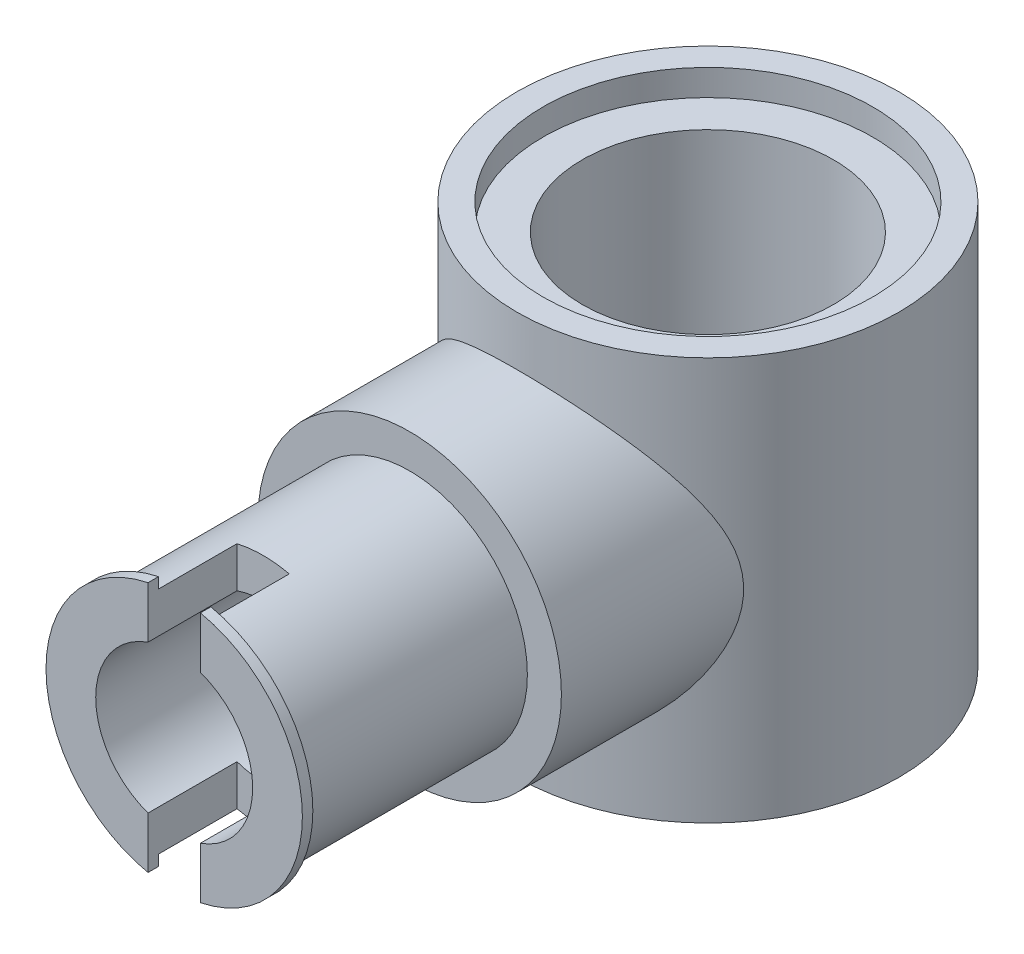
ISO-10303-21;
HEADER;
FILE_DESCRIPTION(('STEP AP214'),'2;1');
FILE_NAME('part.step','',(''),(''),'','','');
FILE_SCHEMA(('AUTOMOTIVE_DESIGN { 1 0 10303 214 1 1 1 1 }'));
ENDSEC;
DATA;
#1=APPLICATION_CONTEXT('core data for automotive mechanical design processes');
#2=APPLICATION_PROTOCOL_DEFINITION('international standard','automotive_design',2000,#1);
#3=PRODUCT_CONTEXT('',#1,'mechanical');
#4=PRODUCT('Part','Part','',(#3));
#5=PRODUCT_RELATED_PRODUCT_CATEGORY('part','',(#4));
#6=PRODUCT_DEFINITION_FORMATION('','',#4);
#7=PRODUCT_DEFINITION_CONTEXT('part definition',#1,'design');
#8=PRODUCT_DEFINITION('design','',#6,#7);
#9=PRODUCT_DEFINITION_SHAPE('','',#8);
#10=(LENGTH_UNIT() NAMED_UNIT(*) SI_UNIT(.MILLI.,.METRE.));
#11=(NAMED_UNIT(*) PLANE_ANGLE_UNIT() SI_UNIT($,.RADIAN.));
#12=(NAMED_UNIT(*) SI_UNIT($,.STERADIAN.) SOLID_ANGLE_UNIT());
#13=UNCERTAINTY_MEASURE_WITH_UNIT(LENGTH_MEASURE(1.E-05),#10,'distance_accuracy_value','');
#14=(GEOMETRIC_REPRESENTATION_CONTEXT(3) GLOBAL_UNCERTAINTY_ASSIGNED_CONTEXT((#13)) GLOBAL_UNIT_ASSIGNED_CONTEXT((#10,
#11,#12)) REPRESENTATION_CONTEXT('',''));
#15=CARTESIAN_POINT('',(0.,0.,0.));
#16=DIRECTION('',(0.,0.,1.));
#17=DIRECTION('',(1.,0.,0.));
#18=AXIS2_PLACEMENT_3D('',#15,#16,#17);
#19=CARTESIAN_POINT('',(0.,3.85,10.));
#20=DIRECTION('',(0.,0.,1.));
#21=DIRECTION('',(1.,0.,0.));
#22=AXIS2_PLACEMENT_3D('',#19,#20,#21);
#23=PLANE('',#22);
#24=CARTESIAN_POINT('',(0.,3.85,10.));
#25=DIRECTION('',(0.,0.,1.));
#26=DIRECTION('',(1.,0.,0.));
#27=AXIS2_PLACEMENT_3D('',#24,#25,#26);
#28=CIRCLE('',#27,2.45);
#29=CARTESIAN_POINT('',(-0.5,6.24843699104229,10.));
#30=VERTEX_POINT('',#29);
#31=CARTESIAN_POINT('',(-0.5,1.45156300895771,10.));
#32=VERTEX_POINT('',#31);
#33=EDGE_CURVE('E155',#30,#32,#28,.T.);
#34=ORIENTED_EDGE('',*,*,#33,.F.);
#35=DIRECTION('',(0.,-1.,0.));
#36=VECTOR('',#35,1.);
#37=CARTESIAN_POINT('',(-0.5,3.85,10.));
#38=LINE('',#37,#36);
#39=CARTESIAN_POINT('',(-0.5,6.04374109684803,10.));
#40=VERTEX_POINT('',#39);
#41=EDGE_CURVE('E127',#30,#40,#38,.T.);
#42=ORIENTED_EDGE('',*,*,#41,.T.);
#43=CARTESIAN_POINT('',(0.,3.85,10.));
#44=DIRECTION('',(0.,0.,1.));
#45=DIRECTION('',(1.,0.,0.));
#46=AXIS2_PLACEMENT_3D('',#43,#44,#45);
#47=CIRCLE('',#46,2.25);
#48=CARTESIAN_POINT('',(-0.5,1.65625890315197,10.));
#49=VERTEX_POINT('',#48);
#50=EDGE_CURVE('E324',#40,#49,#47,.T.);
#51=ORIENTED_EDGE('',*,*,#50,.T.);
#52=EDGE_CURVE('E264',#49,#32,#38,.T.);
#53=ORIENTED_EDGE('',*,*,#52,.T.);
#54=EDGE_LOOP('',(#34,#42,#51,#53));
#55=FACE_BOUND('',#54,.T.);
#56=ADVANCED_FACE('F33',(#55),#23,.F.);
#57=CARTESIAN_POINT('',(0.,3.85,10.2));
#58=DIRECTION('',(0.,0.,-1.));
#59=DIRECTION('',(-1.,0.,0.));
#60=AXIS2_PLACEMENT_3D('',#57,#58,#59);
#61=CYLINDRICAL_SURFACE('',#60,2.45);
#62=CARTESIAN_POINT('',(0.,3.85,10.2));
#63=DIRECTION('',(0.,0.,1.));
#64=DIRECTION('',(1.,0.,0.));
#65=AXIS2_PLACEMENT_3D('',#62,#63,#64);
#66=CIRCLE('',#65,2.45);
#67=CARTESIAN_POINT('',(-0.5,6.24843699104229,10.2));
#68=VERTEX_POINT('',#67);
#69=CARTESIAN_POINT('',(-0.5,1.45156300895771,10.2));
#70=VERTEX_POINT('',#69);
#71=EDGE_CURVE('E139',#68,#70,#66,.T.);
#72=ORIENTED_EDGE('',*,*,#71,.F.);
#73=DIRECTION('',(0.,0.,-1.));
#74=VECTOR('',#73,1.);
#75=CARTESIAN_POINT('',(-0.5,6.24843699104229,10.2));
#76=LINE('',#75,#74);
#77=EDGE_CURVE('E121',#68,#30,#76,.T.);
#78=ORIENTED_EDGE('',*,*,#77,.T.);
#79=ORIENTED_EDGE('',*,*,#33,.T.);
#80=DIRECTION('',(0.,0.,-1.));
#81=VECTOR('',#80,1.);
#82=CARTESIAN_POINT('',(-0.5,1.45156300895771,10.2));
#83=LINE('',#82,#81);
#84=EDGE_CURVE('E147',#32,#70,#83,.F.);
#85=ORIENTED_EDGE('',*,*,#84,.T.);
#86=EDGE_LOOP('',(#72,#78,#79,#85));
#87=FACE_BOUND('',#86,.T.);
#88=ADVANCED_FACE('F146',(#87),#61,.T.);
#89=CARTESIAN_POINT('',(0.,3.85,10.2));
#90=DIRECTION('',(0.,0.,1.));
#91=DIRECTION('',(1.,0.,0.));
#92=AXIS2_PLACEMENT_3D('',#89,#90,#91);
#93=PLANE('',#92);
#94=DIRECTION('',(0.,-1.,0.));
#95=VECTOR('',#94,1.);
#96=CARTESIAN_POINT('',(-0.5,0.860665509218866,10.2));
#97=LINE('',#96,#95);
#98=CARTESIAN_POINT('',(-0.5,5.2642135623731,10.2));
#99=VERTEX_POINT('',#98);
#100=EDGE_CURVE('E124',#68,#99,#97,.T.);
#101=ORIENTED_EDGE('',*,*,#100,.F.);
#102=ORIENTED_EDGE('',*,*,#71,.T.);
#103=CARTESIAN_POINT('',(-0.5,2.4357864376269,10.2));
#104=VERTEX_POINT('',#103);
#105=EDGE_CURVE('E143',#104,#70,#97,.T.);
#106=ORIENTED_EDGE('',*,*,#105,.F.);
#107=CARTESIAN_POINT('',(0.,3.85,10.2));
#108=DIRECTION('',(0.,0.,1.));
#109=DIRECTION('',(1.,0.,0.));
#110=AXIS2_PLACEMENT_3D('',#107,#108,#109);
#111=CIRCLE('',#110,1.5);
#112=EDGE_CURVE('E141',#99,#104,#111,.T.);
#113=ORIENTED_EDGE('',*,*,#112,.F.);
#114=EDGE_LOOP('',(#101,#102,#106,#113));
#115=FACE_BOUND('',#114,.T.);
#116=ADVANCED_FACE('F137',(#115),#93,.T.);
#117=CARTESIAN_POINT('',(0.,3.85,10.2));
#118=DIRECTION('',(0.,0.,-1.));
#119=DIRECTION('',(-1.,0.,0.));
#120=AXIS2_PLACEMENT_3D('',#117,#118,#119);
#121=CYLINDRICAL_SURFACE('',#120,2.25);
#122=ORIENTED_EDGE('',*,*,#50,.F.);
#123=DIRECTION('',(0.,0.,-1.));
#124=VECTOR('',#123,1.);
#125=CARTESIAN_POINT('',(-0.5,6.04374109684803,10.2));
#126=LINE('',#125,#124);
#127=CARTESIAN_POINT('',(-0.5,6.04374109684803,8.5));
#128=VERTEX_POINT('',#127);
#129=EDGE_CURVE('E269',#40,#128,#126,.T.);
#130=ORIENTED_EDGE('',*,*,#129,.T.);
#131=CARTESIAN_POINT('',(0.,3.85,8.5));
#132=DIRECTION('',(0.,0.,1.));
#133=DIRECTION('',(1.,0.,0.));
#134=AXIS2_PLACEMENT_3D('',#131,#132,#133);
#135=CIRCLE('',#134,2.25);
#136=CARTESIAN_POINT('',(0.5,6.04374109684803,8.5));
#137=VERTEX_POINT('',#136);
#138=EDGE_CURVE('E315',#137,#128,#135,.T.);
#139=ORIENTED_EDGE('',*,*,#138,.F.);
#140=DIRECTION('',(0.,0.,-1.));
#141=VECTOR('',#140,1.);
#142=CARTESIAN_POINT('',(0.5,6.04374109684803,10.2));
#143=LINE('',#142,#141);
#144=CARTESIAN_POINT('',(0.5,6.04374109684803,10.));
#145=VERTEX_POINT('',#144);
#146=EDGE_CURVE('E254',#137,#145,#143,.F.);
#147=ORIENTED_EDGE('',*,*,#146,.T.);
#148=CARTESIAN_POINT('',(0.5,1.65625890315197,10.));
#149=VERTEX_POINT('',#148);
#150=EDGE_CURVE('E190',#149,#145,#47,.T.);
#151=ORIENTED_EDGE('',*,*,#150,.F.);
#152=DIRECTION('',(0.,0.,-1.));
#153=VECTOR('',#152,1.);
#154=CARTESIAN_POINT('',(0.5,1.65625890315197,10.2));
#155=LINE('',#154,#153);
#156=CARTESIAN_POINT('',(0.5,1.65625890315197,8.5));
#157=VERTEX_POINT('',#156);
#158=EDGE_CURVE('E256',#149,#157,#155,.T.);
#159=ORIENTED_EDGE('',*,*,#158,.T.);
#160=CARTESIAN_POINT('',(-0.5,1.65625890315197,8.5));
#161=VERTEX_POINT('',#160);
#162=EDGE_CURVE('E311',#161,#157,#135,.T.);
#163=ORIENTED_EDGE('',*,*,#162,.F.);
#164=DIRECTION('',(0.,0.,-1.));
#165=VECTOR('',#164,1.);
#166=CARTESIAN_POINT('',(-0.5,1.65625890315197,10.2));
#167=LINE('',#166,#165);
#168=EDGE_CURVE('E132',#161,#49,#167,.F.);
#169=ORIENTED_EDGE('',*,*,#168,.T.);
#170=EDGE_LOOP('',(#122,#130,#139,#147,#151,#159,#163,#169));
#171=FACE_BOUND('',#170,.T.);
#172=CARTESIAN_POINT('',(0.,3.85,5.7));
#173=DIRECTION('',(0.,0.,1.));
#174=DIRECTION('',(1.,0.,0.));
#175=AXIS2_PLACEMENT_3D('',#172,#173,#174);
#176=CIRCLE('',#175,2.25);
#177=CARTESIAN_POINT('',(2.25,3.85,5.7));
#178=VERTEX_POINT('',#177);
#179=EDGE_CURVE('E148',#178,#178,#176,.F.);
#180=ORIENTED_EDGE('',*,*,#179,.F.);
#181=EDGE_LOOP('',(#180));
#182=FACE_BOUND('',#181,.T.);
#183=ADVANCED_FACE('F213',(#171,#182),#121,.T.);
#184=CARTESIAN_POINT('',(0.,7.7,0.));
#185=DIRECTION('',(0.,-1.,0.));
#186=DIRECTION('',(0.,0.,-1.));
#187=AXIS2_PLACEMENT_3D('',#184,#185,#186);
#188=CYLINDRICAL_SURFACE('',#187,2.4);
#189=CARTESIAN_POINT('',(0.,0.,0.));
#190=DIRECTION('',(0.,1.,0.));
#191=DIRECTION('',(0.,0.,1.));
#192=AXIS2_PLACEMENT_3D('',#189,#190,#191);
#193=CIRCLE('',#192,2.4);
#194=CARTESIAN_POINT('',(0.,0.,2.4));
#195=VERTEX_POINT('',#194);
#196=EDGE_CURVE('E172',#195,#195,#193,.T.);
#197=ORIENTED_EDGE('',*,*,#196,.F.);
#198=EDGE_LOOP('',(#197));
#199=FACE_BOUND('',#198,.T.);
#200=CARTESIAN_POINT('',(0.,7.2,0.));
#201=DIRECTION('',(0.,1.,0.));
#202=DIRECTION('',(0.,0.,1.));
#203=AXIS2_PLACEMENT_3D('',#200,#201,#202);
#204=CIRCLE('',#203,2.4);
#205=CARTESIAN_POINT('',(0.,7.2,2.4));
#206=VERTEX_POINT('',#205);
#207=EDGE_CURVE('E166',#206,#206,#204,.F.);
#208=ORIENTED_EDGE('',*,*,#207,.F.);
#209=EDGE_LOOP('',(#208));
#210=FACE_BOUND('',#209,.T.);
#211=ADVANCED_FACE('F210',(#199,#210),#188,.F.);
#212=CARTESIAN_POINT('',(0.,7.7,0.));
#213=DIRECTION('',(0.,-1.,0.));
#214=DIRECTION('',(0.,0.,-1.));
#215=AXIS2_PLACEMENT_3D('',#212,#213,#214);
#216=CYLINDRICAL_SURFACE('',#215,3.65);
#217=CARTESIAN_POINT('',(0.,7.7,0.));
#218=DIRECTION('',(0.,1.,0.));
#219=DIRECTION('',(0.,0.,1.));
#220=AXIS2_PLACEMENT_3D('',#217,#218,#219);
#221=CIRCLE('',#220,3.65);
#222=CARTESIAN_POINT('',(0.,7.7,3.65));
#223=VERTEX_POINT('',#222);
#224=EDGE_CURVE('E178',#223,#223,#221,.T.);
#225=ORIENTED_EDGE('',*,*,#224,.F.);
#226=EDGE_LOOP('',(#225));
#227=FACE_BOUND('',#226,.T.);
#228=CARTESIAN_POINT('',(0.,0.,0.));
#229=DIRECTION('',(0.,1.,0.));
#230=DIRECTION('',(0.,0.,1.));
#231=AXIS2_PLACEMENT_3D('',#228,#229,#230);
#232=CIRCLE('',#231,3.65);
#233=CARTESIAN_POINT('',(0.,0.,3.65));
#234=VERTEX_POINT('',#233);
#235=EDGE_CURVE('E177',#234,#234,#232,.T.);
#236=ORIENTED_EDGE('',*,*,#235,.T.);
#237=EDGE_LOOP('',(#236));
#238=FACE_BOUND('',#237,.T.);
#239=CARTESIAN_POINT('',(-2.9,3.85,2.21641602593015));
#240=CARTESIAN_POINT('',(-2.89999017022501,3.74004137475367,2.21643868162065));
#241=CARTESIAN_POINT('',(-2.89367921357353,3.62997738900104,2.22476124806554));
#242=CARTESIAN_POINT('',(-2.86903052666121,3.41338207085177,2.25644129938891));
#243=CARTESIAN_POINT('',(-2.85066576404768,3.30685924548753,2.27983257577731));
#244=CARTESIAN_POINT('',(-2.79509469294497,3.06395735965382,2.3478597368524));
#245=CARTESIAN_POINT('',(-2.75358556392495,2.92987522221068,2.3970311997697));
#246=CARTESIAN_POINT('',(-2.65398722183205,2.67294640921925,2.50686077905976));
#247=CARTESIAN_POINT('',(-2.5958494797974,2.55013402963364,2.56755233871525));
#248=CARTESIAN_POINT('',(-2.4858832249792,2.35381091594582,2.67332966189973));
#249=CARTESIAN_POINT('',(-2.43813634629893,2.27724080687653,2.71708332523369));
#250=CARTESIAN_POINT('',(-2.3359840837192,2.1291632666279,2.80539565878704));
#251=CARTESIAN_POINT('',(-2.28157639971326,2.05765759783039,2.8499546025323));
#252=CARTESIAN_POINT('',(-2.10862307479508,1.85101157560476,2.98282694992245));
#253=CARTESIAN_POINT('',(-1.98017990079187,1.7234446856796,3.07050584929848));
#254=CARTESIAN_POINT('',(-1.72539490986177,1.51449390669333,3.21914412010553));
#255=CARTESIAN_POINT('',(-1.60352960585979,1.42895522919615,3.28197946248689));
#256=CARTESIAN_POINT('',(-1.34417441313413,1.27594304418949,3.39642164142454));
#257=CARTESIAN_POINT('',(-1.20670918223702,1.20844157774657,3.44804583250567));
#258=CARTESIAN_POINT('',(-0.941566965793311,1.10402453568489,3.52873593490783));
#259=CARTESIAN_POINT('',(-0.815839065670495,1.0639442824363,3.56008890119209));
#260=CARTESIAN_POINT('',(-0.557607273448412,1.00101843350487,3.60954464580203));
#261=CARTESIAN_POINT('',(-0.425107080789508,0.97816353348605,3.62765457724269));
#262=CARTESIAN_POINT('',(-0.15655132056323,0.951076234352312,3.64913548778026));
#263=CARTESIAN_POINT('',(-0.020485363650936,0.946906236707699,3.65245707841425));
#264=CARTESIAN_POINT('',(0.25040627259994,0.957652764022638,3.64392122703523));
#265=CARTESIAN_POINT('',(0.38523187845415,0.972570412584853,3.63206289144918));
#266=CARTESIAN_POINT('',(0.64254133627312,1.01921364558,3.59522762372204));
#267=CARTESIAN_POINT('',(0.765301434151249,1.05001485822636,3.57097275782778));
#268=CARTESIAN_POINT('',(1.00335808159002,1.12623247486155,3.51152987371167));
#269=CARTESIAN_POINT('',(1.11865276092762,1.17165252424957,3.47633912856009));
#270=CARTESIAN_POINT('',(1.3508734656933,1.28033977266401,3.39327317566014));
#271=CARTESIAN_POINT('',(1.46685632721924,1.34491795930891,3.3444940395111));
#272=CARTESIAN_POINT('',(1.68657274664263,1.48724010563042,3.23926515308094));
#273=CARTESIAN_POINT('',(1.79029901860869,1.5649918301505,3.18281088276616));
#274=CARTESIAN_POINT('',(2.00503609102986,1.7491066062766,3.05305088808305));
#275=CARTESIAN_POINT('',(2.11316497130316,1.85806595223167,2.97866599918755));
#276=CARTESIAN_POINT('',(2.31068628416735,2.09099547798283,2.82818685265163));
#277=CARTESIAN_POINT('',(2.4000570063509,2.21498279207067,2.75209072595088));
#278=CARTESIAN_POINT('',(2.55044865474007,2.46296819672295,2.61285475047779));
#279=CARTESIAN_POINT('',(2.61351368615225,2.58544255958085,2.54921360574498));
#280=CARTESIAN_POINT('',(2.72282065064106,2.84221588489959,2.4321050890598));
#281=CARTESIAN_POINT('',(2.76909946376408,2.97648811008004,2.3786155385089));
#282=CARTESIAN_POINT('',(2.83165738943487,3.21576811912489,2.30345352429243));
#283=CARTESIAN_POINT('',(2.85274280191331,3.31799418395623,2.27705297983948));
#284=CARTESIAN_POINT('',(2.88382401430859,3.52655192924293,2.23756783218943));
#285=CARTESIAN_POINT('',(2.89384350434095,3.63287433284482,2.2244547878746));
#286=CARTESIAN_POINT('',(2.90199105361494,3.84734870685613,2.21382212265557));
#287=CARTESIAN_POINT('',(2.90005800292729,3.95550725519242,2.21638263550693));
#288=CARTESIAN_POINT('',(2.88434602400711,4.16954587663115,2.23678140668301));
#289=CARTESIAN_POINT('',(2.8705498044414,4.27542239250548,2.25464196566744));
#290=CARTESIAN_POINT('',(2.82704846503125,4.51001912513321,2.3090658968354));
#291=CARTESIAN_POINT('',(2.79406368513755,4.63722909604877,2.34936628268724));
#292=CARTESIAN_POINT('',(2.71319192269824,4.88214886762533,2.44230727915116));
#293=CARTESIAN_POINT('',(2.66526120387565,4.99982949264372,2.49498399358941));
#294=CARTESIAN_POINT('',(2.57152512685965,5.19362809484717,2.59093134116119));
#295=CARTESIAN_POINT('',(2.52892944668478,5.2721109063793,2.63266755585079));
#296=CARTESIAN_POINT('',(2.43716199306337,5.42420947314247,2.71784044008107));
#297=CARTESIAN_POINT('',(2.3879876705265,5.49782332514394,2.76127776412942));
#298=CARTESIAN_POINT('',(2.28321987855321,5.64017318945224,2.84851902718819));
#299=CARTESIAN_POINT('',(2.22762262480804,5.70890628718025,2.89232316808121));
#300=CARTESIAN_POINT('',(2.11008182212832,5.84133008638347,2.97916047194784));
#301=CARTESIAN_POINT('',(2.04813502400204,5.90501817637584,3.02219322682141));
#302=CARTESIAN_POINT('',(1.91722934830722,6.02769802058283,3.10690835404333));
#303=CARTESIAN_POINT('',(1.84819812210067,6.08662745200319,3.14856954685618));
#304=CARTESIAN_POINT('',(1.70384349875707,6.19845709735168,3.22896918871975));
#305=CARTESIAN_POINT('',(1.62852147859268,6.25135862474663,3.26770827386697));
#306=CARTESIAN_POINT('',(1.47197522094115,6.35036763280155,3.3411433884052));
#307=CARTESIAN_POINT('',(1.39076675151505,6.39649233035605,3.37584961481921));
#308=CARTESIAN_POINT('',(1.22274287346461,6.481303285201,3.44027592939181));
#309=CARTESIAN_POINT('',(1.13593071004586,6.519993797045,3.46999886821637));
#310=CARTESIAN_POINT('',(0.925796932241551,6.60129721267021,3.53288146254069));
#311=CARTESIAN_POINT('',(0.800369893744636,6.64050681958393,3.56357549954455));
#312=CARTESIAN_POINT('',(0.543002193188847,6.70177564949886,3.6117538630527));
#313=CARTESIAN_POINT('',(0.411066531270852,6.72384782637533,3.62924816671529));
#314=CARTESIAN_POINT('',(0.143812313425281,6.74954888310233,3.64963289780244));
#315=CARTESIAN_POINT('',(0.008484092731752,6.75311711791905,3.65247530474952));
#316=CARTESIAN_POINT('',(-0.260830489426669,6.74139073845494,3.6431618365785));
#317=CARTESIAN_POINT('',(-0.394816691914621,6.72609391542909,3.63100420523672));
#318=CARTESIAN_POINT('',(-0.65119303615723,6.67880756480946,3.59366880080517));
#319=CARTESIAN_POINT('',(-0.77383213647124,6.64763783600179,3.56913096404577));
#320=CARTESIAN_POINT('',(-1.01159174836076,6.57071894476892,3.5091641386322));
#321=CARTESIAN_POINT('',(-1.12671033476722,6.52496606670272,3.47373237439543));
#322=CARTESIAN_POINT('',(-1.35871663940171,6.41553031295777,3.39014336058634));
#323=CARTESIAN_POINT('',(-1.47464031131888,6.35051621211714,3.34107060867178));
#324=CARTESIAN_POINT('',(-1.69417974281856,6.20732070317798,3.23529461047029));
#325=CARTESIAN_POINT('',(-1.79778784081228,6.12913117092628,3.17858666057727));
#326=CARTESIAN_POINT('',(-2.0122811134754,5.94397783055004,3.04828407403936));
#327=CARTESIAN_POINT('',(-2.12026065904479,5.83440535258741,2.97361870258032));
#328=CARTESIAN_POINT('',(-2.31736878341614,5.60022247554546,2.82271159352503));
#329=CARTESIAN_POINT('',(-2.40647847071285,5.47559720053497,2.74646835927658));
#330=CARTESIAN_POINT('',(-2.55560584330107,5.22741083172945,2.60777167789633));
#331=CARTESIAN_POINT('',(-2.61782451119463,5.10549124983411,2.54475743471412));
#332=CARTESIAN_POINT('',(-2.72566832707142,4.84996532061175,2.42888151122382));
#333=CARTESIAN_POINT('',(-2.77131735691761,4.71637614027424,2.37600527129907));
#334=CARTESIAN_POINT('',(-2.83728010947113,4.46155234982444,2.29664917271207));
#335=CARTESIAN_POINT('',(-2.86058310109455,4.34208333028639,2.26720874598352));
#336=CARTESIAN_POINT('',(-2.88411280937693,4.1593095611986,2.23708399177194));
#337=CARTESIAN_POINT('',(-2.89005165447277,4.09785593225462,2.22938246529706));
#338=CARTESIAN_POINT('',(-2.89799770017783,3.97427934865364,2.21904250126726));
#339=CARTESIAN_POINT('',(-2.90000555649437,3.91215650736298,2.21640321930775));
#340=CARTESIAN_POINT('',(-2.9,3.85,2.21641602593015));
#341=B_SPLINE_CURVE_WITH_KNOTS('',3,(#239,#240,#241,#242,#243,#244,#245,#246,#247,#248,#249,
#250,#251,#252,#253,#254,#255,#256,#257,#258,#259,#260,#261,#262,#263,#264,#265,#266,#267,#268,
#269,#270,#271,#272,#273,#274,#275,#276,#277,#278,#279,#280,#281,#282,#283,#284,#285,#286,#287,
#288,#289,#290,#291,#292,#293,#294,#295,#296,#297,#298,#299,#300,#301,#302,#303,#304,#305,#306,
#307,#308,#309,#310,#311,#312,#313,#314,#315,#316,#317,#318,#319,#320,#321,#322,#323,#324,#325,
#326,#327,#328,#329,#330,#331,#332,#333,#334,#335,#336,#337,#338,#339,#340),.UNSPECIFIED.,.T.,
.F.,(4,2,2,2,2,2,2,2,2,2,2,2,2,2,2,2,2,2,2,2,2,2,2,2,2,2,2,2,2,2,2,2,2,2,2,2,2,2,2,2,2,2,2,2,2,
2,2,2,2,2,4),(0.,0.329614139074661,0.659970021532331,1.10367853141106,1.54869540953802,
1.8492043617122,2.14981737977854,2.74991282358736,3.23296182665031,3.71525766855859,
4.12044127246689,4.52540585784126,4.93172188946534,5.33806184016116,5.72305040359865,
6.10813504347255,6.53087975338963,6.95387451301824,7.46377679566058,7.97426601629968,
8.42818586178934,8.88110229707985,9.20289581791636,9.52399909425139,9.84674543277852,
10.1699629938381,10.5800679811719,10.9913845022737,11.2867529196486,11.5822361195765,
11.8778943109472,12.1737045592242,12.4729114478965,12.7720530148742,13.07042094381,
13.3686176060879,13.7716523993208,14.1743822484092,14.5784311785442,14.9825274197347,
15.367598800018,15.7527683711828,16.1762690946059,16.6000319164628,17.1111854805324,
17.6228483901437,18.0735638450787,18.5236270786767,18.897109642353,19.0834622992375,
19.2697838689774),.UNSPECIFIED.);
#342=CARTESIAN_POINT('',(-2.9,3.85,2.21641602593015));
#343=VERTEX_POINT('',#342);
#344=EDGE_CURVE('E181',#343,#343,#341,.T.);
#345=ORIENTED_EDGE('',*,*,#344,.F.);
#346=EDGE_LOOP('',(#345));
#347=FACE_BOUND('',#346,.T.);
#348=ADVANCED_FACE('F35',(#227,#238,#347),#216,.T.);
#349=CARTESIAN_POINT('',(0.,7.7,0.));
#350=DIRECTION('',(0.,1.,0.));
#351=DIRECTION('',(0.,0.,1.));
#352=AXIS2_PLACEMENT_3D('',#349,#350,#351);
#353=PLANE('',#352);
#354=CARTESIAN_POINT('',(0.,7.7,0.));
#355=DIRECTION('',(0.,1.,0.));
#356=DIRECTION('',(0.,0.,1.));
#357=AXIS2_PLACEMENT_3D('',#354,#355,#356);
#358=CIRCLE('',#357,3.15);
#359=CARTESIAN_POINT('',(0.,7.7,3.15));
#360=VERTEX_POINT('',#359);
#361=EDGE_CURVE('E165',#360,#360,#358,.T.);
#362=ORIENTED_EDGE('',*,*,#361,.F.);
#363=EDGE_LOOP('',(#362));
#364=FACE_BOUND('',#363,.T.);
#365=ORIENTED_EDGE('',*,*,#224,.T.);
#366=EDGE_LOOP('',(#365));
#367=FACE_BOUND('',#366,.T.);
#368=ADVANCED_FACE('F215',(#364,#367),#353,.T.);
#369=CARTESIAN_POINT('',(0.,0.,0.));
#370=DIRECTION('',(0.,1.,0.));
#371=DIRECTION('',(0.,0.,1.));
#372=AXIS2_PLACEMENT_3D('',#369,#370,#371);
#373=PLANE('',#372);
#374=ORIENTED_EDGE('',*,*,#235,.F.);
#375=EDGE_LOOP('',(#374));
#376=FACE_BOUND('',#375,.T.);
#377=ORIENTED_EDGE('',*,*,#196,.T.);
#378=EDGE_LOOP('',(#377));
#379=FACE_BOUND('',#378,.T.);
#380=ADVANCED_FACE('F208',(#376,#379),#373,.F.);
#381=CARTESIAN_POINT('',(0.,7.2,0.));
#382=DIRECTION('',(0.,1.,0.));
#383=DIRECTION('',(0.,0.,1.));
#384=AXIS2_PLACEMENT_3D('',#381,#382,#383);
#385=CYLINDRICAL_SURFACE('',#384,3.15);
#386=CARTESIAN_POINT('',(0.,7.2,0.));
#387=DIRECTION('',(0.,1.,0.));
#388=DIRECTION('',(0.,0.,1.));
#389=AXIS2_PLACEMENT_3D('',#386,#387,#388);
#390=CIRCLE('',#389,3.15);
#391=CARTESIAN_POINT('',(0.,7.2,3.15));
#392=VERTEX_POINT('',#391);
#393=EDGE_CURVE('E169',#392,#392,#390,.T.);
#394=ORIENTED_EDGE('',*,*,#393,.F.);
#395=EDGE_LOOP('',(#394));
#396=FACE_BOUND('',#395,.T.);
#397=ORIENTED_EDGE('',*,*,#361,.T.);
#398=EDGE_LOOP('',(#397));
#399=FACE_BOUND('',#398,.T.);
#400=ADVANCED_FACE('F204',(#396,#399),#385,.F.);
#401=CARTESIAN_POINT('',(0.,7.2,0.));
#402=DIRECTION('',(0.,1.,0.));
#403=DIRECTION('',(0.,0.,1.));
#404=AXIS2_PLACEMENT_3D('',#401,#402,#403);
#405=PLANE('',#404);
#406=ORIENTED_EDGE('',*,*,#207,.T.);
#407=EDGE_LOOP('',(#406));
#408=FACE_BOUND('',#407,.T.);
#409=ORIENTED_EDGE('',*,*,#393,.T.);
#410=EDGE_LOOP('',(#409));
#411=FACE_BOUND('',#410,.T.);
#412=ADVANCED_FACE('F201',(#408,#411),#405,.T.);
#413=CARTESIAN_POINT('',(0.,3.85,5.7));
#414=DIRECTION('',(0.,0.,1.));
#415=DIRECTION('',(1.,0.,0.));
#416=AXIS2_PLACEMENT_3D('',#413,#414,#415);
#417=PLANE('',#416);
#418=ORIENTED_EDGE('',*,*,#179,.T.);
#419=EDGE_LOOP('',(#418));
#420=FACE_BOUND('',#419,.T.);
#421=CARTESIAN_POINT('',(0.,3.85,5.7));
#422=DIRECTION('',(0.,0.,1.));
#423=DIRECTION('',(1.,0.,0.));
#424=AXIS2_PLACEMENT_3D('',#421,#422,#423);
#425=CIRCLE('',#424,2.9);
#426=CARTESIAN_POINT('',(2.9,3.85,5.7));
#427=VERTEX_POINT('',#426);
#428=EDGE_CURVE('E152',#427,#427,#425,.T.);
#429=ORIENTED_EDGE('',*,*,#428,.T.);
#430=EDGE_LOOP('',(#429));
#431=FACE_BOUND('',#430,.T.);
#432=ADVANCED_FACE('F198',(#420,#431),#417,.T.);
#433=CARTESIAN_POINT('',(0.,3.85,5.7));
#434=DIRECTION('',(0.,0.,-1.));
#435=DIRECTION('',(-1.,0.,0.));
#436=AXIS2_PLACEMENT_3D('',#433,#434,#435);
#437=CYLINDRICAL_SURFACE('',#436,2.9);
#438=ORIENTED_EDGE('',*,*,#428,.F.);
#439=EDGE_LOOP('',(#438));
#440=FACE_BOUND('',#439,.T.);
#441=ORIENTED_EDGE('',*,*,#344,.T.);
#442=EDGE_LOOP('',(#441));
#443=FACE_BOUND('',#442,.T.);
#444=ADVANCED_FACE('F192',(#440,#443),#437,.T.);
#445=CARTESIAN_POINT('',(0.5,1.45156300895771,10.));
#446=VERTEX_POINT('',#445);
#447=CARTESIAN_POINT('',(0.5,6.24843699104229,10.));
#448=VERTEX_POINT('',#447);
#449=EDGE_CURVE('E160',#446,#448,#28,.T.);
#450=ORIENTED_EDGE('',*,*,#449,.F.);
#451=DIRECTION('',(0.,1.,0.));
#452=VECTOR('',#451,1.);
#453=CARTESIAN_POINT('',(0.5,3.85,10.));
#454=LINE('',#453,#452);
#455=EDGE_CURVE('E244',#446,#149,#454,.T.);
#456=ORIENTED_EDGE('',*,*,#455,.T.);
#457=ORIENTED_EDGE('',*,*,#150,.T.);
#458=EDGE_CURVE('E246',#145,#448,#454,.T.);
#459=ORIENTED_EDGE('',*,*,#458,.T.);
#460=EDGE_LOOP('',(#450,#456,#457,#459));
#461=FACE_BOUND('',#460,.T.);
#462=ADVANCED_FACE('F197',(#461),#23,.F.);
#463=CARTESIAN_POINT('',(0.5,1.45156300895771,10.2));
#464=VERTEX_POINT('',#463);
#465=CARTESIAN_POINT('',(0.5,6.24843699104229,10.2));
#466=VERTEX_POINT('',#465);
#467=EDGE_CURVE('E149',#464,#466,#66,.T.);
#468=ORIENTED_EDGE('',*,*,#467,.F.);
#469=DIRECTION('',(0.,0.,-1.));
#470=VECTOR('',#469,1.);
#471=CARTESIAN_POINT('',(0.5,1.45156300895771,10.2));
#472=LINE('',#471,#470);
#473=EDGE_CURVE('E251',#464,#446,#472,.T.);
#474=ORIENTED_EDGE('',*,*,#473,.T.);
#475=ORIENTED_EDGE('',*,*,#449,.T.);
#476=DIRECTION('',(0.,0.,-1.));
#477=VECTOR('',#476,1.);
#478=CARTESIAN_POINT('',(0.5,6.24843699104229,10.2));
#479=LINE('',#478,#477);
#480=EDGE_CURVE('E250',#448,#466,#479,.F.);
#481=ORIENTED_EDGE('',*,*,#480,.T.);
#482=EDGE_LOOP('',(#468,#474,#475,#481));
#483=FACE_BOUND('',#482,.T.);
#484=ADVANCED_FACE('F231',(#483),#61,.T.);
#485=DIRECTION('',(0.,1.,0.));
#486=VECTOR('',#485,1.);
#487=CARTESIAN_POINT('',(0.5,0.860665509218866,10.2));
#488=LINE('',#487,#486);
#489=CARTESIAN_POINT('',(0.5,2.4357864376269,10.2));
#490=VERTEX_POINT('',#489);
#491=EDGE_CURVE('E338',#464,#490,#488,.T.);
#492=ORIENTED_EDGE('',*,*,#491,.F.);
#493=ORIENTED_EDGE('',*,*,#467,.T.);
#494=CARTESIAN_POINT('',(0.5,5.2642135623731,10.2));
#495=VERTEX_POINT('',#494);
#496=EDGE_CURVE('E142',#495,#466,#488,.T.);
#497=ORIENTED_EDGE('',*,*,#496,.F.);
#498=EDGE_CURVE('E271',#490,#495,#111,.T.);
#499=ORIENTED_EDGE('',*,*,#498,.F.);
#500=EDGE_LOOP('',(#492,#493,#497,#499));
#501=FACE_BOUND('',#500,.T.);
#502=ADVANCED_FACE('F238',(#501),#93,.T.);
#503=CARTESIAN_POINT('',(0.,3.85,10.2));
#504=DIRECTION('',(0.,0.,-1.));
#505=DIRECTION('',(-1.,0.,0.));
#506=AXIS2_PLACEMENT_3D('',#503,#504,#505);
#507=CYLINDRICAL_SURFACE('',#506,1.5);
#508=DIRECTION('',(0.,0.,-1.));
#509=VECTOR('',#508,1.);
#510=CARTESIAN_POINT('',(-0.5,5.2642135623731,10.2));
#511=LINE('',#510,#509);
#512=CARTESIAN_POINT('',(-0.5,5.2642135623731,8.5));
#513=VERTEX_POINT('',#512);
#514=EDGE_CURVE('E11',#99,#513,#511,.T.);
#515=ORIENTED_EDGE('',*,*,#514,.F.);
#516=ORIENTED_EDGE('',*,*,#112,.T.);
#517=DIRECTION('',(0.,0.,-1.));
#518=VECTOR('',#517,1.);
#519=CARTESIAN_POINT('',(-0.5,2.4357864376269,10.2));
#520=LINE('',#519,#518);
#521=CARTESIAN_POINT('',(-0.5,2.4357864376269,8.5));
#522=VERTEX_POINT('',#521);
#523=EDGE_CURVE('E329',#522,#104,#520,.F.);
#524=ORIENTED_EDGE('',*,*,#523,.F.);
#525=CARTESIAN_POINT('',(0.,3.85,8.5));
#526=DIRECTION('',(0.,0.,1.));
#527=DIRECTION('',(1.,0.,0.));
#528=AXIS2_PLACEMENT_3D('',#525,#526,#527);
#529=CIRCLE('',#528,1.5);
#530=CARTESIAN_POINT('',(0.5,2.4357864376269,8.5));
#531=VERTEX_POINT('',#530);
#532=EDGE_CURVE('E326',#522,#531,#529,.T.);
#533=ORIENTED_EDGE('',*,*,#532,.T.);
#534=DIRECTION('',(0.,0.,-1.));
#535=VECTOR('',#534,1.);
#536=CARTESIAN_POINT('',(0.5,2.4357864376269,10.2));
#537=LINE('',#536,#535);
#538=EDGE_CURVE('E317',#490,#531,#537,.T.);
#539=ORIENTED_EDGE('',*,*,#538,.F.);
#540=ORIENTED_EDGE('',*,*,#498,.T.);
#541=DIRECTION('',(0.,0.,-1.));
#542=VECTOR('',#541,1.);
#543=CARTESIAN_POINT('',(0.5,5.2642135623731,10.2));
#544=LINE('',#543,#542);
#545=CARTESIAN_POINT('',(0.5,5.2642135623731,8.5));
#546=VERTEX_POINT('',#545);
#547=EDGE_CURVE('E42',#546,#495,#544,.F.);
#548=ORIENTED_EDGE('',*,*,#547,.F.);
#549=EDGE_CURVE('E327',#546,#513,#529,.T.);
#550=ORIENTED_EDGE('',*,*,#549,.T.);
#551=EDGE_LOOP('',(#515,#516,#524,#533,#539,#540,#548,#550));
#552=FACE_BOUND('',#551,.T.);
#553=CARTESIAN_POINT('',(0.,3.85,2.85));
#554=DIRECTION('',(0.,0.,1.));
#555=DIRECTION('',(1.,0.,0.));
#556=AXIS2_PLACEMENT_3D('',#553,#554,#555);
#557=CIRCLE('',#556,1.5);
#558=CARTESIAN_POINT('',(1.5,3.85,2.85));
#559=VERTEX_POINT('',#558);
#560=EDGE_CURVE('E158',#559,#559,#557,.T.);
#561=ORIENTED_EDGE('',*,*,#560,.F.);
#562=EDGE_LOOP('',(#561));
#563=FACE_BOUND('',#562,.T.);
#564=ADVANCED_FACE('F282',(#552,#563),#507,.F.);
#565=CARTESIAN_POINT('',(0.,3.85,2.85));
#566=DIRECTION('',(0.,0.,1.));
#567=DIRECTION('',(1.,0.,0.));
#568=AXIS2_PLACEMENT_3D('',#565,#566,#567);
#569=PLANE('',#568);
#570=ORIENTED_EDGE('',*,*,#560,.T.);
#571=EDGE_LOOP('',(#570));
#572=FACE_BOUND('',#571,.T.);
#573=ADVANCED_FACE('F280',(#572),#569,.T.);
#574=CARTESIAN_POINT('',(0.,0.,8.5));
#575=DIRECTION('',(0.,0.,1.));
#576=DIRECTION('',(1.,0.,0.));
#577=AXIS2_PLACEMENT_3D('',#574,#575,#576);
#578=PLANE('',#577);
#579=ORIENTED_EDGE('',*,*,#162,.T.);
#580=DIRECTION('',(0.,1.,0.));
#581=VECTOR('',#580,1.);
#582=CARTESIAN_POINT('',(0.5,0.860665509218866,8.5));
#583=LINE('',#582,#581);
#584=EDGE_CURVE('E56',#157,#531,#583,.T.);
#585=ORIENTED_EDGE('',*,*,#584,.T.);
#586=ORIENTED_EDGE('',*,*,#532,.F.);
#587=DIRECTION('',(0.,-1.,0.));
#588=VECTOR('',#587,1.);
#589=CARTESIAN_POINT('',(-0.5,0.860665509218866,8.5));
#590=LINE('',#589,#588);
#591=EDGE_CURVE('E313',#522,#161,#590,.T.);
#592=ORIENTED_EDGE('',*,*,#591,.T.);
#593=EDGE_LOOP('',(#579,#585,#586,#592));
#594=FACE_BOUND('',#593,.T.);
#595=ADVANCED_FACE('F288',(#594),#578,.T.);
#596=CARTESIAN_POINT('',(0.5,0.860665509218866,8.5));
#597=DIRECTION('',(1.,0.,0.));
#598=DIRECTION('',(0.,1.,0.));
#599=AXIS2_PLACEMENT_3D('',#596,#597,#598);
#600=PLANE('',#599);
#601=ORIENTED_EDGE('',*,*,#455,.F.);
#602=ORIENTED_EDGE('',*,*,#473,.F.);
#603=ORIENTED_EDGE('',*,*,#491,.T.);
#604=ORIENTED_EDGE('',*,*,#538,.T.);
#605=ORIENTED_EDGE('',*,*,#584,.F.);
#606=ORIENTED_EDGE('',*,*,#158,.F.);
#607=EDGE_LOOP('',(#601,#602,#603,#604,#605,#606));
#608=FACE_BOUND('',#607,.T.);
#609=ADVANCED_FACE('F297',(#608),#600,.F.);
#610=CARTESIAN_POINT('',(-0.5,0.860665509218866,8.5));
#611=DIRECTION('',(-1.,0.,0.));
#612=DIRECTION('',(0.,0.,1.));
#613=AXIS2_PLACEMENT_3D('',#610,#611,#612);
#614=PLANE('',#613);
#615=ORIENTED_EDGE('',*,*,#591,.F.);
#616=ORIENTED_EDGE('',*,*,#523,.T.);
#617=ORIENTED_EDGE('',*,*,#105,.T.);
#618=ORIENTED_EDGE('',*,*,#84,.F.);
#619=ORIENTED_EDGE('',*,*,#52,.F.);
#620=ORIENTED_EDGE('',*,*,#168,.F.);
#621=EDGE_LOOP('',(#615,#616,#617,#618,#619,#620));
#622=FACE_BOUND('',#621,.T.);
#623=ADVANCED_FACE('F296',(#622),#614,.F.);
#624=ORIENTED_EDGE('',*,*,#41,.F.);
#625=ORIENTED_EDGE('',*,*,#77,.F.);
#626=ORIENTED_EDGE('',*,*,#100,.T.);
#627=ORIENTED_EDGE('',*,*,#514,.T.);
#628=EDGE_CURVE('E49',#128,#513,#590,.T.);
#629=ORIENTED_EDGE('',*,*,#628,.F.);
#630=ORIENTED_EDGE('',*,*,#129,.F.);
#631=EDGE_LOOP('',(#624,#625,#626,#627,#629,#630));
#632=FACE_BOUND('',#631,.T.);
#633=ADVANCED_FACE('F123',(#632),#614,.F.);
#634=EDGE_CURVE('E319',#546,#137,#583,.T.);
#635=ORIENTED_EDGE('',*,*,#634,.F.);
#636=ORIENTED_EDGE('',*,*,#547,.T.);
#637=ORIENTED_EDGE('',*,*,#496,.T.);
#638=ORIENTED_EDGE('',*,*,#480,.F.);
#639=ORIENTED_EDGE('',*,*,#458,.F.);
#640=ORIENTED_EDGE('',*,*,#146,.F.);
#641=EDGE_LOOP('',(#635,#636,#637,#638,#639,#640));
#642=FACE_BOUND('',#641,.T.);
#643=ADVANCED_FACE('F295',(#642),#600,.F.);
#644=ORIENTED_EDGE('',*,*,#138,.T.);
#645=ORIENTED_EDGE('',*,*,#628,.T.);
#646=ORIENTED_EDGE('',*,*,#549,.F.);
#647=ORIENTED_EDGE('',*,*,#634,.T.);
#648=EDGE_LOOP('',(#644,#645,#646,#647));
#649=FACE_BOUND('',#648,.T.);
#650=ADVANCED_FACE('F300',(#649),#578,.T.);
#651=CLOSED_SHELL('',(#56,#88,#116,#183,#211,#348,#368,#380,#400,#412,#432,#444,#462,#484,#502,
#564,#573,#595,#609,#623,#633,#643,#650));
#652=MANIFOLD_SOLID_BREP('B2',#651);
#653=ADVANCED_BREP_SHAPE_REPRESENTATION('',(#18,#652),#14);
#654=SHAPE_DEFINITION_REPRESENTATION(#9,#653);
ENDSEC;
END-ISO-10303-21;
